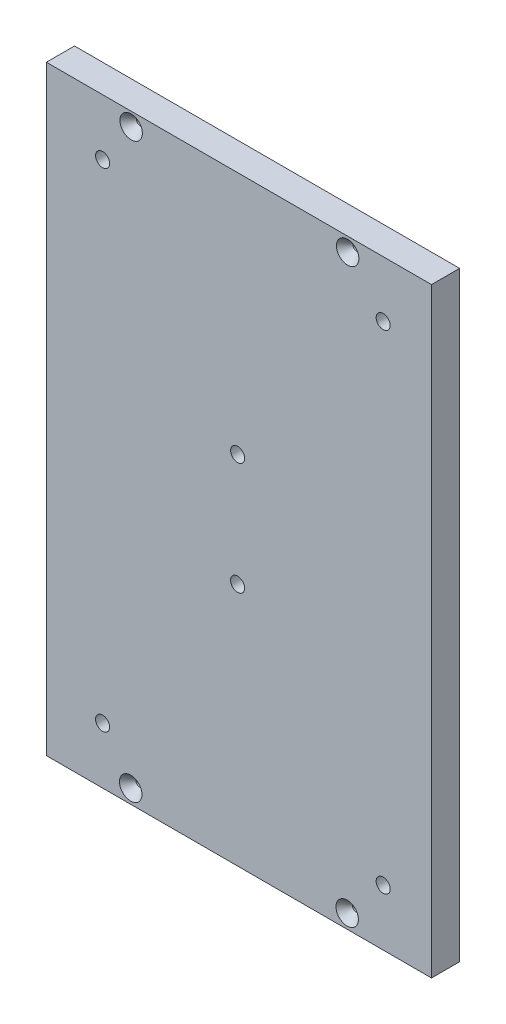
ISO-10303-21;
HEADER;
FILE_DESCRIPTION(('STEP AP214'),'2;1');
FILE_NAME('part.step','',(''),(''),'','','');
FILE_SCHEMA(('AUTOMOTIVE_DESIGN { 1 0 10303 214 1 1 1 1 }'));
ENDSEC;
DATA;
#1=APPLICATION_CONTEXT('core data for automotive mechanical design processes');
#2=APPLICATION_PROTOCOL_DEFINITION('international standard','automotive_design',2000,#1);
#3=PRODUCT_CONTEXT('',#1,'mechanical');
#4=PRODUCT('Part','Part','',(#3));
#5=PRODUCT_RELATED_PRODUCT_CATEGORY('part','',(#4));
#6=PRODUCT_DEFINITION_FORMATION('','',#4);
#7=PRODUCT_DEFINITION_CONTEXT('part definition',#1,'design');
#8=PRODUCT_DEFINITION('design','',#6,#7);
#9=PRODUCT_DEFINITION_SHAPE('','',#8);
#10=(LENGTH_UNIT() NAMED_UNIT(*) SI_UNIT(.MILLI.,.METRE.));
#11=(NAMED_UNIT(*) PLANE_ANGLE_UNIT() SI_UNIT($,.RADIAN.));
#12=(NAMED_UNIT(*) SI_UNIT($,.STERADIAN.) SOLID_ANGLE_UNIT());
#13=UNCERTAINTY_MEASURE_WITH_UNIT(LENGTH_MEASURE(1.E-05),#10,'distance_accuracy_value','');
#14=(GEOMETRIC_REPRESENTATION_CONTEXT(3) GLOBAL_UNCERTAINTY_ASSIGNED_CONTEXT((#13)) GLOBAL_UNIT_ASSIGNED_CONTEXT((#10,
#11,#12)) REPRESENTATION_CONTEXT('',''));
#15=CARTESIAN_POINT('',(0.,0.,0.));
#16=DIRECTION('',(0.,0.,1.));
#17=DIRECTION('',(1.,0.,0.));
#18=AXIS2_PLACEMENT_3D('',#15,#16,#17);
#19=CARTESIAN_POINT('',(125.242491642913,3.60822483003176E-13,12.6999999999999));
#20=DIRECTION('',(1.00000000000001,0.,0.));
#21=DIRECTION('',(0.,0.,-1.00000000000001));
#22=AXIS2_PLACEMENT_3D('',#19,#20,#21);
#23=PLANE('',#22);
#24=DIRECTION('',(0.,-1.,0.));
#25=VECTOR('',#24,1.);
#26=CARTESIAN_POINT('',(125.242491642913,3.60822483003176E-13,-1.77635683940025E-12));
#27=LINE('',#26,#25);
#28=CARTESIAN_POINT('',(125.242491642912,271.365530146065,1.77635683940025E-12));
#29=VERTEX_POINT('',#28);
#30=CARTESIAN_POINT('',(125.242491642913,3.60822483003176E-13,-1.77635683940025E-12));
#31=VERTEX_POINT('',#30);
#32=EDGE_CURVE('E102',#29,#31,#27,.T.);
#33=ORIENTED_EDGE('',*,*,#32,.T.);
#34=DIRECTION('',(0.,0.,-1.00000000000001));
#35=VECTOR('',#34,1.);
#36=CARTESIAN_POINT('',(125.242491642913,3.60822483003176E-13,12.6999999999999));
#37=LINE('',#36,#35);
#38=CARTESIAN_POINT('',(125.242491642913,3.60822483003176E-13,12.6999999999999));
#39=VERTEX_POINT('',#38);
#40=EDGE_CURVE('E11',#39,#31,#37,.T.);
#41=ORIENTED_EDGE('',*,*,#40,.F.);
#42=DIRECTION('',(0.,-1.,0.));
#43=VECTOR('',#42,1.);
#44=CARTESIAN_POINT('',(125.242491642913,3.60822483003176E-13,12.6999999999999));
#45=LINE('',#44,#43);
#46=CARTESIAN_POINT('',(125.242491642914,271.365530146065,12.7000000000039));
#47=VERTEX_POINT('',#46);
#48=EDGE_CURVE('E89',#47,#39,#45,.T.);
#49=ORIENTED_EDGE('',*,*,#48,.F.);
#50=DIRECTION('',(0.,0.,-1.00000000000001));
#51=VECTOR('',#50,1.);
#52=CARTESIAN_POINT('',(125.242491642914,271.365530146065,12.7000000000039));
#53=LINE('',#52,#51);
#54=EDGE_CURVE('E98',#47,#29,#53,.T.);
#55=ORIENTED_EDGE('',*,*,#54,.T.);
#56=EDGE_LOOP('',(#33,#41,#49,#55));
#57=FACE_BOUND('',#56,.T.);
#58=ADVANCED_FACE('F36',(#57),#23,.F.);
#59=CARTESIAN_POINT('',(125.242491642913,3.60822483003176E-13,12.6999999999999));
#60=DIRECTION('',(0.,1.,0.));
#61=DIRECTION('',(0.,0.,1.00000000000001));
#62=AXIS2_PLACEMENT_3D('',#59,#60,#61);
#63=PLANE('',#62);
#64=DIRECTION('',(1.00000000000001,0.,0.));
#65=VECTOR('',#64,1.);
#66=CARTESIAN_POINT('',(125.242491642913,3.60822483003176E-13,-1.77635683940025E-12));
#67=LINE('',#66,#65);
#68=CARTESIAN_POINT('',(299.263797608769,4.71844785465692E-13,-1.11022302462516E-12));
#69=VERTEX_POINT('',#68);
#70=EDGE_CURVE('E93',#31,#69,#67,.T.);
#71=ORIENTED_EDGE('',*,*,#70,.T.);
#72=DIRECTION('',(0.,0.,-1.00000000000001));
#73=VECTOR('',#72,1.);
#74=CARTESIAN_POINT('',(299.263797608767,4.71844785465692E-13,12.7000000000004));
#75=LINE('',#74,#73);
#76=CARTESIAN_POINT('',(299.263797608767,4.71844785465692E-13,12.7000000000004));
#77=VERTEX_POINT('',#76);
#78=EDGE_CURVE('E45',#77,#69,#75,.T.);
#79=ORIENTED_EDGE('',*,*,#78,.F.);
#80=DIRECTION('',(1.00000000000001,0.,0.));
#81=VECTOR('',#80,1.);
#82=CARTESIAN_POINT('',(125.242491642913,3.60822483003176E-13,12.6999999999999));
#83=LINE('',#82,#81);
#84=EDGE_CURVE('E84',#39,#77,#83,.T.);
#85=ORIENTED_EDGE('',*,*,#84,.F.);
#86=ORIENTED_EDGE('',*,*,#40,.T.);
#87=EDGE_LOOP('',(#71,#79,#85,#86));
#88=FACE_BOUND('',#87,.T.);
#89=ADVANCED_FACE('F92',(#88),#63,.F.);
#90=CARTESIAN_POINT('',(299.263797608767,4.71844785465692E-13,12.7000000000004));
#91=DIRECTION('',(-1.00000000000001,0.,0.));
#92=DIRECTION('',(0.,-1.,0.));
#93=AXIS2_PLACEMENT_3D('',#90,#91,#92);
#94=PLANE('',#93);
#95=DIRECTION('',(0.,1.,0.));
#96=VECTOR('',#95,1.);
#97=CARTESIAN_POINT('',(299.263797608769,4.71844785465692E-13,-1.11022302462516E-12));
#98=LINE('',#97,#96);
#99=CARTESIAN_POINT('',(299.263797608769,271.365530146065,2.88657986402541E-12));
#100=VERTEX_POINT('',#99);
#101=EDGE_CURVE('E71',#69,#100,#98,.T.);
#102=ORIENTED_EDGE('',*,*,#101,.T.);
#103=DIRECTION('',(0.,0.,-1.00000000000001));
#104=VECTOR('',#103,1.);
#105=CARTESIAN_POINT('',(299.263797608767,271.365530146065,12.7000000000026));
#106=LINE('',#105,#104);
#107=CARTESIAN_POINT('',(299.263797608767,271.365530146065,12.7000000000026));
#108=VERTEX_POINT('',#107);
#109=EDGE_CURVE('E94',#108,#100,#106,.T.);
#110=ORIENTED_EDGE('',*,*,#109,.F.);
#111=DIRECTION('',(0.,1.,0.));
#112=VECTOR('',#111,1.);
#113=CARTESIAN_POINT('',(299.263797608767,4.71844785465692E-13,12.7000000000004));
#114=LINE('',#113,#112);
#115=EDGE_CURVE('E87',#77,#108,#114,.T.);
#116=ORIENTED_EDGE('',*,*,#115,.F.);
#117=ORIENTED_EDGE('',*,*,#78,.T.);
#118=EDGE_LOOP('',(#102,#110,#116,#117));
#119=FACE_BOUND('',#118,.T.);
#120=ADVANCED_FACE('F96',(#119),#94,.F.);
#121=CARTESIAN_POINT('',(125.242491642914,271.365530146065,12.7000000000039));
#122=DIRECTION('',(0.,-1.,0.));
#123=DIRECTION('',(1.00000000000001,0.,0.));
#124=AXIS2_PLACEMENT_3D('',#121,#122,#123);
#125=PLANE('',#124);
#126=DIRECTION('',(-1.00000000000001,0.,0.));
#127=VECTOR('',#126,1.);
#128=CARTESIAN_POINT('',(125.242491642912,271.365530146065,1.77635683940025E-12));
#129=LINE('',#128,#127);
#130=EDGE_CURVE('E77',#100,#29,#129,.T.);
#131=ORIENTED_EDGE('',*,*,#130,.T.);
#132=ORIENTED_EDGE('',*,*,#54,.F.);
#133=DIRECTION('',(-1.00000000000001,0.,0.));
#134=VECTOR('',#133,1.);
#135=CARTESIAN_POINT('',(125.242491642914,271.365530146065,12.7000000000039));
#136=LINE('',#135,#134);
#137=EDGE_CURVE('E54',#108,#47,#136,.T.);
#138=ORIENTED_EDGE('',*,*,#137,.F.);
#139=ORIENTED_EDGE('',*,*,#109,.T.);
#140=EDGE_LOOP('',(#131,#132,#138,#139));
#141=FACE_BOUND('',#140,.T.);
#142=ADVANCED_FACE('F193',(#141),#125,.F.);
#143=CARTESIAN_POINT('',(9.99200722162641E-13,0.,12.6999999999968));
#144=DIRECTION('',(0.,0.,-1.00000000000001));
#145=DIRECTION('',(-1.00000000000001,0.,0.));
#146=AXIS2_PLACEMENT_3D('',#143,#144,#145);
#147=PLANE('',#146);
#148=CARTESIAN_POINT('',(163.342491642911,6.35000000000019,12.7000000000306));
#149=DIRECTION('',(0.,0.,1.00000000000001));
#150=DIRECTION('',(1.00000000000001,0.,0.));
#151=AXIS2_PLACEMENT_3D('',#148,#149,#150);
#152=CIRCLE('',#151,5.08);
#153=CARTESIAN_POINT('',(168.422491642911,6.35000000000019,12.7000000000306));
#154=VERTEX_POINT('',#153);
#155=EDGE_CURVE('E374',#154,#154,#152,.T.);
#156=ORIENTED_EDGE('',*,*,#155,.F.);
#157=EDGE_LOOP('',(#156));
#158=FACE_BOUND('',#157,.T.);
#159=CARTESIAN_POINT('',(261.163797608766,6.35000000000019,12.7000000000344));
#160=DIRECTION('',(0.,0.,1.00000000000001));
#161=DIRECTION('',(1.00000000000001,0.,0.));
#162=AXIS2_PLACEMENT_3D('',#159,#160,#161);
#163=CIRCLE('',#162,5.07999999999997);
#164=CARTESIAN_POINT('',(266.243797608766,6.35000000000019,12.7000000000344));
#165=VERTEX_POINT('',#164);
#166=EDGE_CURVE('E129',#165,#165,#163,.T.);
#167=ORIENTED_EDGE('',*,*,#166,.F.);
#168=EDGE_LOOP('',(#167));
#169=FACE_BOUND('',#168,.T.);
#170=CARTESIAN_POINT('',(163.542078970706,265.224961390802,12.7000000000383));
#171=DIRECTION('',(0.,0.,1.00000000000001));
#172=DIRECTION('',(1.00000000000001,0.,0.));
#173=AXIS2_PLACEMENT_3D('',#170,#171,#172);
#174=CIRCLE('',#173,5.08);
#175=CARTESIAN_POINT('',(168.622078970706,265.224961390802,12.7000000000383));
#176=VERTEX_POINT('',#175);
#177=EDGE_CURVE('E122',#176,#176,#174,.T.);
#178=ORIENTED_EDGE('',*,*,#177,.F.);
#179=EDGE_LOOP('',(#178));
#180=FACE_BOUND('',#179,.T.);
#181=CARTESIAN_POINT('',(261.363268644776,265.074125007485,12.7000000000377));
#182=DIRECTION('',(0.,0.,1.00000000000001));
#183=DIRECTION('',(1.00000000000001,0.,0.));
#184=AXIS2_PLACEMENT_3D('',#181,#182,#183);
#185=CIRCLE('',#184,5.07999999999997);
#186=CARTESIAN_POINT('',(266.443268644776,265.074125007485,12.7000000000377));
#187=VERTEX_POINT('',#186);
#188=EDGE_CURVE('E118',#187,#187,#185,.T.);
#189=ORIENTED_EDGE('',*,*,#188,.F.);
#190=EDGE_LOOP('',(#189));
#191=FACE_BOUND('',#190,.T.);
#192=CARTESIAN_POINT('',(277.426568304693,245.965530146065,12.7000000000013));
#193=DIRECTION('',(0.,0.,-1.00000000000001));
#194=DIRECTION('',(-1.00000000000001,0.,0.));
#195=AXIS2_PLACEMENT_3D('',#192,#193,#194);
#196=CIRCLE('',#195,3.17499999999998);
#197=CARTESIAN_POINT('',(274.251568304693,245.965530146065,12.7000000000013));
#198=VERTEX_POINT('',#197);
#199=EDGE_CURVE('E145',#198,#198,#196,.T.);
#200=ORIENTED_EDGE('',*,*,#199,.T.);
#201=EDGE_LOOP('',(#200));
#202=FACE_BOUND('',#201,.T.);
#203=CARTESIAN_POINT('',(211.653264176212,161.082765073035,12.699999999999));
#204=DIRECTION('',(0.,0.,-1.00000000000001));
#205=DIRECTION('',(-1.00000000000001,0.,0.));
#206=AXIS2_PLACEMENT_3D('',#203,#204,#205);
#207=CIRCLE('',#206,3.17499999999998);
#208=CARTESIAN_POINT('',(208.478264176212,161.082765073035,12.699999999999));
#209=VERTEX_POINT('',#208);
#210=EDGE_CURVE('E151',#209,#209,#207,.T.);
#211=ORIENTED_EDGE('',*,*,#210,.T.);
#212=EDGE_LOOP('',(#211));
#213=FACE_BOUND('',#212,.T.);
#214=CARTESIAN_POINT('',(150.642491642913,245.965530146065,12.6999999999986));
#215=DIRECTION('',(0.,0.,-1.00000000000001));
#216=DIRECTION('',(-1.00000000000001,0.,0.));
#217=AXIS2_PLACEMENT_3D('',#214,#215,#216);
#218=CIRCLE('',#217,3.17499999999998);
#219=CARTESIAN_POINT('',(147.467491642913,245.965530146065,12.6999999999986));
#220=VERTEX_POINT('',#219);
#221=EDGE_CURVE('E157',#220,#220,#218,.T.);
#222=ORIENTED_EDGE('',*,*,#221,.T.);
#223=EDGE_LOOP('',(#222));
#224=FACE_BOUND('',#223,.T.);
#225=CARTESIAN_POINT('',(211.653264176211,110.282765073031,12.7000000000039));
#226=DIRECTION('',(0.,0.,-1.00000000000001));
#227=DIRECTION('',(-1.00000000000001,0.,0.));
#228=AXIS2_PLACEMENT_3D('',#225,#226,#227);
#229=CIRCLE('',#228,3.17499999999998);
#230=CARTESIAN_POINT('',(208.478264176211,110.282765073031,12.7000000000039));
#231=VERTEX_POINT('',#230);
#232=EDGE_CURVE('E163',#231,#231,#229,.T.);
#233=ORIENTED_EDGE('',*,*,#232,.T.);
#234=EDGE_LOOP('',(#233));
#235=FACE_BOUND('',#234,.T.);
#236=CARTESIAN_POINT('',(277.426568304692,25.4000000000033,12.7000000000039));
#237=DIRECTION('',(0.,0.,-1.00000000000001));
#238=DIRECTION('',(-1.00000000000001,0.,0.));
#239=AXIS2_PLACEMENT_3D('',#236,#237,#238);
#240=CIRCLE('',#239,3.17499999999998);
#241=CARTESIAN_POINT('',(274.251568304692,25.4000000000033,12.7000000000039));
#242=VERTEX_POINT('',#241);
#243=EDGE_CURVE('E169',#242,#242,#240,.T.);
#244=ORIENTED_EDGE('',*,*,#243,.T.);
#245=EDGE_LOOP('',(#244));
#246=FACE_BOUND('',#245,.T.);
#247=CARTESIAN_POINT('',(150.642491642912,25.4000000000033,12.7000000000008));
#248=DIRECTION('',(0.,0.,-1.00000000000001));
#249=DIRECTION('',(-1.00000000000001,0.,0.));
#250=AXIS2_PLACEMENT_3D('',#247,#248,#249);
#251=CIRCLE('',#250,3.17499999999998);
#252=CARTESIAN_POINT('',(147.467491642912,25.4000000000033,12.7000000000008));
#253=VERTEX_POINT('',#252);
#254=EDGE_CURVE('E105',#253,#253,#251,.T.);
#255=ORIENTED_EDGE('',*,*,#254,.T.);
#256=EDGE_LOOP('',(#255));
#257=FACE_BOUND('',#256,.T.);
#258=ORIENTED_EDGE('',*,*,#48,.T.);
#259=ORIENTED_EDGE('',*,*,#84,.T.);
#260=ORIENTED_EDGE('',*,*,#115,.T.);
#261=ORIENTED_EDGE('',*,*,#137,.T.);
#262=EDGE_LOOP('',(#258,#259,#260,#261));
#263=FACE_BOUND('',#262,.T.);
#264=ADVANCED_FACE('F85',(#158,#169,#180,#191,#202,#213,#224,#235,#246,#257,#263),#147,.F.);
#265=CARTESIAN_POINT('',(0.,0.,0.));
#266=DIRECTION('',(0.,0.,-1.00000000000001));
#267=DIRECTION('',(-1.00000000000001,0.,0.));
#268=AXIS2_PLACEMENT_3D('',#265,#266,#267);
#269=PLANE('',#268);
#270=CARTESIAN_POINT('',(163.342491642913,6.35000000000019,-2.22044604925031E-12));
#271=DIRECTION('',(0.,0.,-1.00000000000001));
#272=DIRECTION('',(-1.00000000000001,0.,0.));
#273=AXIS2_PLACEMENT_3D('',#270,#271,#272);
#274=CIRCLE('',#273,1.58749999999999);
#275=CARTESIAN_POINT('',(161.754991642913,6.35000000000019,-2.22046808023846E-12));
#276=VERTEX_POINT('',#275);
#277=EDGE_CURVE('E39',#276,#276,#274,.T.);
#278=ORIENTED_EDGE('',*,*,#277,.F.);
#279=EDGE_LOOP('',(#278));
#280=FACE_BOUND('',#279,.T.);
#281=CARTESIAN_POINT('',(261.163797608767,6.35000000000019,-1.55431223447522E-12));
#282=DIRECTION('',(0.,0.,-1.00000000000001));
#283=DIRECTION('',(-1.00000000000001,0.,0.));
#284=AXIS2_PLACEMENT_3D('',#281,#282,#283);
#285=CIRCLE('',#284,1.58750000000002);
#286=CARTESIAN_POINT('',(259.576297608767,6.35000000000019,-1.55433426546336E-12));
#287=VERTEX_POINT('',#286);
#288=EDGE_CURVE('E120',#287,#287,#285,.T.);
#289=ORIENTED_EDGE('',*,*,#288,.F.);
#290=EDGE_LOOP('',(#289));
#291=FACE_BOUND('',#290,.T.);
#292=CARTESIAN_POINT('',(163.542078970706,265.224961390802,2.44249065417534E-12));
#293=DIRECTION('',(0.,0.,-1.00000000000001));
#294=DIRECTION('',(-1.00000000000001,0.,0.));
#295=AXIS2_PLACEMENT_3D('',#292,#293,#294);
#296=CIRCLE('',#295,1.58749999999999);
#297=CARTESIAN_POINT('',(161.954578970706,265.224961390802,2.4424686231872E-12));
#298=VERTEX_POINT('',#297);
#299=EDGE_CURVE('E116',#298,#298,#296,.T.);
#300=ORIENTED_EDGE('',*,*,#299,.F.);
#301=EDGE_LOOP('',(#300));
#302=FACE_BOUND('',#301,.T.);
#303=CARTESIAN_POINT('',(261.363268644775,265.074125007485,5.32907051820075E-12));
#304=DIRECTION('',(0.,0.,-1.00000000000001));
#305=DIRECTION('',(-1.00000000000001,0.,0.));
#306=AXIS2_PLACEMENT_3D('',#303,#304,#305);
#307=CIRCLE('',#306,1.58750000000002);
#308=CARTESIAN_POINT('',(259.775768644775,265.074125007485,5.32904848721261E-12));
#309=VERTEX_POINT('',#308);
#310=EDGE_CURVE('E111',#309,#309,#307,.T.);
#311=ORIENTED_EDGE('',*,*,#310,.F.);
#312=EDGE_LOOP('',(#311));
#313=FACE_BOUND('',#312,.T.);
#314=CARTESIAN_POINT('',(277.426568304693,245.965530146065,6.66133814775094E-13));
#315=DIRECTION('',(0.,0.,-1.00000000000001));
#316=DIRECTION('',(-1.00000000000001,0.,0.));
#317=AXIS2_PLACEMENT_3D('',#314,#315,#316);
#318=CIRCLE('',#317,3.17499999999998);
#319=CARTESIAN_POINT('',(274.251568304693,245.965530146065,6.66089752798804E-13));
#320=VERTEX_POINT('',#319);
#321=EDGE_CURVE('E114',#320,#320,#318,.T.);
#322=ORIENTED_EDGE('',*,*,#321,.F.);
#323=EDGE_LOOP('',(#322));
#324=FACE_BOUND('',#323,.T.);
#325=CARTESIAN_POINT('',(211.653264176211,161.082765073035,-3.33066907387547E-12));
#326=DIRECTION('',(0.,0.,-1.00000000000001));
#327=DIRECTION('',(-1.00000000000001,0.,0.));
#328=AXIS2_PLACEMENT_3D('',#325,#326,#327);
#329=CIRCLE('',#328,3.17499999999998);
#330=CARTESIAN_POINT('',(208.478264176211,161.082765073035,-3.33071313585176E-12));
#331=VERTEX_POINT('',#330);
#332=EDGE_CURVE('E148',#331,#331,#329,.T.);
#333=ORIENTED_EDGE('',*,*,#332,.F.);
#334=EDGE_LOOP('',(#333));
#335=FACE_BOUND('',#334,.T.);
#336=CARTESIAN_POINT('',(150.642491642912,245.965530146065,8.88178419700125E-13));
#337=DIRECTION('',(0.,0.,-1.00000000000001));
#338=DIRECTION('',(-1.00000000000001,0.,0.));
#339=AXIS2_PLACEMENT_3D('',#336,#337,#338);
#340=CIRCLE('',#339,3.17499999999998);
#341=CARTESIAN_POINT('',(147.467491642912,245.965530146065,8.88134357723835E-13));
#342=VERTEX_POINT('',#341);
#343=EDGE_CURVE('E154',#342,#342,#340,.T.);
#344=ORIENTED_EDGE('',*,*,#343,.F.);
#345=EDGE_LOOP('',(#344));
#346=FACE_BOUND('',#345,.T.);
#347=CARTESIAN_POINT('',(211.653264176211,110.282765073031,1.99840144432528E-12));
#348=DIRECTION('',(0.,0.,-1.00000000000001));
#349=DIRECTION('',(-1.00000000000001,0.,0.));
#350=AXIS2_PLACEMENT_3D('',#347,#348,#349);
#351=CIRCLE('',#350,3.17499999999998);
#352=CARTESIAN_POINT('',(208.478264176211,110.282765073031,1.99835738234899E-12));
#353=VERTEX_POINT('',#352);
#354=EDGE_CURVE('E160',#353,#353,#351,.T.);
#355=ORIENTED_EDGE('',*,*,#354,.F.);
#356=EDGE_LOOP('',(#355));
#357=FACE_BOUND('',#356,.T.);
#358=CARTESIAN_POINT('',(277.426568304692,25.4000000000033,1.77635683940025E-12));
#359=DIRECTION('',(0.,0.,-1.00000000000001));
#360=DIRECTION('',(-1.00000000000001,0.,0.));
#361=AXIS2_PLACEMENT_3D('',#358,#359,#360);
#362=CIRCLE('',#361,3.17499999999998);
#363=CARTESIAN_POINT('',(274.251568304692,25.4000000000033,1.77631277742396E-12));
#364=VERTEX_POINT('',#363);
#365=EDGE_CURVE('E166',#364,#364,#362,.T.);
#366=ORIENTED_EDGE('',*,*,#365,.F.);
#367=EDGE_LOOP('',(#366));
#368=FACE_BOUND('',#367,.T.);
#369=CARTESIAN_POINT('',(150.642491642912,25.4000000000033,8.88178419700125E-13));
#370=DIRECTION('',(0.,0.,-1.00000000000001));
#371=DIRECTION('',(-1.00000000000001,0.,0.));
#372=AXIS2_PLACEMENT_3D('',#369,#370,#371);
#373=CIRCLE('',#372,3.17499999999998);
#374=CARTESIAN_POINT('',(147.467491642912,25.4000000000033,8.88134357723835E-13));
#375=VERTEX_POINT('',#374);
#376=EDGE_CURVE('E172',#375,#375,#373,.T.);
#377=ORIENTED_EDGE('',*,*,#376,.F.);
#378=EDGE_LOOP('',(#377));
#379=FACE_BOUND('',#378,.T.);
#380=ORIENTED_EDGE('',*,*,#32,.F.);
#381=ORIENTED_EDGE('',*,*,#130,.F.);
#382=ORIENTED_EDGE('',*,*,#101,.F.);
#383=ORIENTED_EDGE('',*,*,#70,.F.);
#384=EDGE_LOOP('',(#380,#381,#382,#383));
#385=FACE_BOUND('',#384,.T.);
#386=ADVANCED_FACE('F183',(#280,#291,#302,#313,#324,#335,#346,#357,#368,#379,#385),#269,.T.);
#387=CARTESIAN_POINT('',(150.642491642912,25.4000000000033,8.88178419700125E-13));
#388=DIRECTION('',(0.,0.,-1.00000000000001));
#389=DIRECTION('',(-1.00000000000001,0.,0.));
#390=AXIS2_PLACEMENT_3D('',#387,#388,#389);
#391=CYLINDRICAL_SURFACE('',#390,3.17499999999998);
#392=ORIENTED_EDGE('',*,*,#254,.F.);
#393=EDGE_LOOP('',(#392));
#394=FACE_BOUND('',#393,.T.);
#395=ORIENTED_EDGE('',*,*,#376,.T.);
#396=EDGE_LOOP('',(#395));
#397=FACE_BOUND('',#396,.T.);
#398=ADVANCED_FACE('F179',(#394,#397),#391,.F.);
#399=CARTESIAN_POINT('',(277.426568304692,25.4000000000033,1.77635683940025E-12));
#400=DIRECTION('',(0.,0.,-1.00000000000001));
#401=DIRECTION('',(-1.00000000000001,0.,0.));
#402=AXIS2_PLACEMENT_3D('',#399,#400,#401);
#403=CYLINDRICAL_SURFACE('',#402,3.17499999999998);
#404=ORIENTED_EDGE('',*,*,#243,.F.);
#405=EDGE_LOOP('',(#404));
#406=FACE_BOUND('',#405,.T.);
#407=ORIENTED_EDGE('',*,*,#365,.T.);
#408=EDGE_LOOP('',(#407));
#409=FACE_BOUND('',#408,.T.);
#410=ADVANCED_FACE('F182',(#406,#409),#403,.F.);
#411=CARTESIAN_POINT('',(211.653264176211,110.282765073031,1.99840144432528E-12));
#412=DIRECTION('',(0.,0.,-1.00000000000001));
#413=DIRECTION('',(-1.00000000000001,0.,0.));
#414=AXIS2_PLACEMENT_3D('',#411,#412,#413);
#415=CYLINDRICAL_SURFACE('',#414,3.17499999999998);
#416=ORIENTED_EDGE('',*,*,#232,.F.);
#417=EDGE_LOOP('',(#416));
#418=FACE_BOUND('',#417,.T.);
#419=ORIENTED_EDGE('',*,*,#354,.T.);
#420=EDGE_LOOP('',(#419));
#421=FACE_BOUND('',#420,.T.);
#422=ADVANCED_FACE('F245',(#418,#421),#415,.F.);
#423=CARTESIAN_POINT('',(150.642491642912,245.965530146065,8.88178419700125E-13));
#424=DIRECTION('',(0.,0.,-1.00000000000001));
#425=DIRECTION('',(-1.00000000000001,0.,0.));
#426=AXIS2_PLACEMENT_3D('',#423,#424,#425);
#427=CYLINDRICAL_SURFACE('',#426,3.17499999999998);
#428=ORIENTED_EDGE('',*,*,#221,.F.);
#429=EDGE_LOOP('',(#428));
#430=FACE_BOUND('',#429,.T.);
#431=ORIENTED_EDGE('',*,*,#343,.T.);
#432=EDGE_LOOP('',(#431));
#433=FACE_BOUND('',#432,.T.);
#434=ADVANCED_FACE('F255',(#430,#433),#427,.F.);
#435=CARTESIAN_POINT('',(211.653264176211,161.082765073035,-3.33066907387547E-12));
#436=DIRECTION('',(0.,0.,-1.00000000000001));
#437=DIRECTION('',(-1.00000000000001,0.,0.));
#438=AXIS2_PLACEMENT_3D('',#435,#436,#437);
#439=CYLINDRICAL_SURFACE('',#438,3.17499999999998);
#440=ORIENTED_EDGE('',*,*,#210,.F.);
#441=EDGE_LOOP('',(#440));
#442=FACE_BOUND('',#441,.T.);
#443=ORIENTED_EDGE('',*,*,#332,.T.);
#444=EDGE_LOOP('',(#443));
#445=FACE_BOUND('',#444,.T.);
#446=ADVANCED_FACE('F265',(#442,#445),#439,.F.);
#447=CARTESIAN_POINT('',(277.426568304693,245.965530146065,6.66133814775094E-13));
#448=DIRECTION('',(0.,0.,-1.00000000000001));
#449=DIRECTION('',(-1.00000000000001,0.,0.));
#450=AXIS2_PLACEMENT_3D('',#447,#448,#449);
#451=CYLINDRICAL_SURFACE('',#450,3.17499999999998);
#452=ORIENTED_EDGE('',*,*,#199,.F.);
#453=EDGE_LOOP('',(#452));
#454=FACE_BOUND('',#453,.T.);
#455=ORIENTED_EDGE('',*,*,#321,.T.);
#456=EDGE_LOOP('',(#455));
#457=FACE_BOUND('',#456,.T.);
#458=ADVANCED_FACE('F275',(#454,#457),#451,.F.);
#459=CARTESIAN_POINT('',(261.363268644776,265.074125007485,12.7000000000377));
#460=DIRECTION('',(0.,0.,1.00000000000001));
#461=DIRECTION('',(1.00000000000001,0.,0.));
#462=AXIS2_PLACEMENT_3D('',#459,#460,#461);
#463=CYLINDRICAL_SURFACE('',#462,1.58750000000002);
#464=ORIENTED_EDGE('',*,*,#310,.T.);
#465=EDGE_LOOP('',(#464));
#466=FACE_BOUND('',#465,.T.);
#467=CARTESIAN_POINT('',(261.363268644777,265.074125007485,8.68233833781873));
#468=DIRECTION('',(0.,0.,1.00000000000001));
#469=DIRECTION('',(1.00000000000001,0.,0.));
#470=AXIS2_PLACEMENT_3D('',#467,#468,#469);
#471=CIRCLE('',#470,1.58750000000002);
#472=CARTESIAN_POINT('',(262.950768644777,265.074125007485,8.68233833781873));
#473=VERTEX_POINT('',#472);
#474=EDGE_CURVE('E115',#473,#473,#471,.T.);
#475=ORIENTED_EDGE('',*,*,#474,.T.);
#476=EDGE_LOOP('',(#475));
#477=FACE_BOUND('',#476,.T.);
#478=ADVANCED_FACE('F285',(#466,#477),#463,.F.);
#479=CARTESIAN_POINT('',(261.363268644776,265.074125007485,12.7000000000377));
#480=DIRECTION('',(0.,0.,1.00000000000001));
#481=DIRECTION('',(1.00000000000001,0.,0.));
#482=AXIS2_PLACEMENT_3D('',#479,#480,#481);
#483=CONICAL_SURFACE('',#482,5.07999999999997,0.71558499331767);
#484=ORIENTED_EDGE('',*,*,#474,.F.);
#485=EDGE_LOOP('',(#484));
#486=FACE_BOUND('',#485,.T.);
#487=ORIENTED_EDGE('',*,*,#188,.T.);
#488=EDGE_LOOP('',(#487));
#489=FACE_BOUND('',#488,.T.);
#490=ADVANCED_FACE('F295',(#486,#489),#483,.F.);
#491=CARTESIAN_POINT('',(163.542078970706,265.224961390802,12.7000000000383));
#492=DIRECTION('',(0.,0.,1.00000000000001));
#493=DIRECTION('',(1.00000000000001,0.,0.));
#494=AXIS2_PLACEMENT_3D('',#491,#492,#493);
#495=CYLINDRICAL_SURFACE('',#494,1.58749999999999);
#496=ORIENTED_EDGE('',*,*,#299,.T.);
#497=EDGE_LOOP('',(#496));
#498=FACE_BOUND('',#497,.T.);
#499=CARTESIAN_POINT('',(163.542078970705,265.224961390803,8.68233833781895));
#500=DIRECTION('',(0.,0.,1.00000000000001));
#501=DIRECTION('',(1.00000000000001,0.,0.));
#502=AXIS2_PLACEMENT_3D('',#499,#500,#501);
#503=CIRCLE('',#502,1.58749999999999);
#504=CARTESIAN_POINT('',(165.129578970705,265.224961390803,8.68233833781895));
#505=VERTEX_POINT('',#504);
#506=EDGE_CURVE('E119',#505,#505,#503,.T.);
#507=ORIENTED_EDGE('',*,*,#506,.T.);
#508=EDGE_LOOP('',(#507));
#509=FACE_BOUND('',#508,.T.);
#510=ADVANCED_FACE('F305',(#498,#509),#495,.F.);
#511=CARTESIAN_POINT('',(163.542078970706,265.224961390802,12.7000000000383));
#512=DIRECTION('',(0.,0.,1.00000000000001));
#513=DIRECTION('',(1.00000000000001,0.,0.));
#514=AXIS2_PLACEMENT_3D('',#511,#512,#513);
#515=CONICAL_SURFACE('',#514,5.08,0.715584993317678);
#516=ORIENTED_EDGE('',*,*,#506,.F.);
#517=EDGE_LOOP('',(#516));
#518=FACE_BOUND('',#517,.T.);
#519=ORIENTED_EDGE('',*,*,#177,.T.);
#520=EDGE_LOOP('',(#519));
#521=FACE_BOUND('',#520,.T.);
#522=ADVANCED_FACE('F315',(#518,#521),#515,.F.);
#523=CARTESIAN_POINT('',(261.163797608766,6.35000000000019,12.7000000000344));
#524=DIRECTION('',(0.,0.,1.00000000000001));
#525=DIRECTION('',(1.00000000000001,0.,0.));
#526=AXIS2_PLACEMENT_3D('',#523,#524,#525);
#527=CYLINDRICAL_SURFACE('',#526,1.58750000000002);
#528=ORIENTED_EDGE('',*,*,#288,.T.);
#529=EDGE_LOOP('',(#528));
#530=FACE_BOUND('',#529,.T.);
#531=CARTESIAN_POINT('',(261.163797608767,6.35000000000019,8.68233833781562));
#532=DIRECTION('',(0.,0.,1.00000000000001));
#533=DIRECTION('',(1.00000000000001,0.,0.));
#534=AXIS2_PLACEMENT_3D('',#531,#532,#533);
#535=CIRCLE('',#534,1.58750000000002);
#536=CARTESIAN_POINT('',(262.751297608767,6.35000000000019,8.68233833781562));
#537=VERTEX_POINT('',#536);
#538=EDGE_CURVE('E123',#537,#537,#535,.T.);
#539=ORIENTED_EDGE('',*,*,#538,.T.);
#540=EDGE_LOOP('',(#539));
#541=FACE_BOUND('',#540,.T.);
#542=ADVANCED_FACE('F325',(#530,#541),#527,.F.);
#543=CARTESIAN_POINT('',(261.163797608766,6.35000000000019,12.7000000000344));
#544=DIRECTION('',(0.,0.,1.00000000000001));
#545=DIRECTION('',(1.00000000000001,0.,0.));
#546=AXIS2_PLACEMENT_3D('',#543,#544,#545);
#547=CONICAL_SURFACE('',#546,5.07999999999997,0.71558499331767);
#548=ORIENTED_EDGE('',*,*,#538,.F.);
#549=EDGE_LOOP('',(#548));
#550=FACE_BOUND('',#549,.T.);
#551=ORIENTED_EDGE('',*,*,#166,.T.);
#552=EDGE_LOOP('',(#551));
#553=FACE_BOUND('',#552,.T.);
#554=ADVANCED_FACE('F335',(#550,#553),#547,.F.);
#555=CARTESIAN_POINT('',(163.342491642911,6.35000000000019,12.7000000000306));
#556=DIRECTION('',(0.,0.,1.00000000000001));
#557=DIRECTION('',(1.00000000000001,0.,0.));
#558=AXIS2_PLACEMENT_3D('',#555,#556,#557);
#559=CYLINDRICAL_SURFACE('',#558,1.58749999999999);
#560=ORIENTED_EDGE('',*,*,#277,.T.);
#561=EDGE_LOOP('',(#560));
#562=FACE_BOUND('',#561,.T.);
#563=CARTESIAN_POINT('',(163.342491642912,6.35000000000008,8.68233833781118));
#564=DIRECTION('',(0.,0.,1.00000000000001));
#565=DIRECTION('',(1.00000000000001,0.,0.));
#566=AXIS2_PLACEMENT_3D('',#563,#564,#565);
#567=CIRCLE('',#566,1.58749999999999);
#568=CARTESIAN_POINT('',(164.929991642912,6.35000000000008,8.68233833781118));
#569=VERTEX_POINT('',#568);
#570=EDGE_CURVE('E371',#569,#569,#567,.T.);
#571=ORIENTED_EDGE('',*,*,#570,.T.);
#572=EDGE_LOOP('',(#571));
#573=FACE_BOUND('',#572,.T.);
#574=ADVANCED_FACE('F344',(#562,#573),#559,.F.);
#575=CARTESIAN_POINT('',(163.342491642911,6.35000000000019,12.7000000000306));
#576=DIRECTION('',(0.,0.,1.00000000000001));
#577=DIRECTION('',(1.00000000000001,0.,0.));
#578=AXIS2_PLACEMENT_3D('',#575,#576,#577);
#579=CONICAL_SURFACE('',#578,5.08,0.715584993317678);
#580=ORIENTED_EDGE('',*,*,#570,.F.);
#581=EDGE_LOOP('',(#580));
#582=FACE_BOUND('',#581,.T.);
#583=ORIENTED_EDGE('',*,*,#155,.T.);
#584=EDGE_LOOP('',(#583));
#585=FACE_BOUND('',#584,.T.);
#586=ADVANCED_FACE('F354',(#582,#585),#579,.F.);
#587=CLOSED_SHELL('',(#58,#89,#120,#142,#264,#386,#398,#410,#422,#434,#446,#458,#478,#490,#510,
#522,#542,#554,#574,#586));
#588=MANIFOLD_SOLID_BREP('B2',#587);
#589=ADVANCED_BREP_SHAPE_REPRESENTATION('',(#18,#588),#14);
#590=SHAPE_DEFINITION_REPRESENTATION(#9,#589);
ENDSEC;
END-ISO-10303-21;
